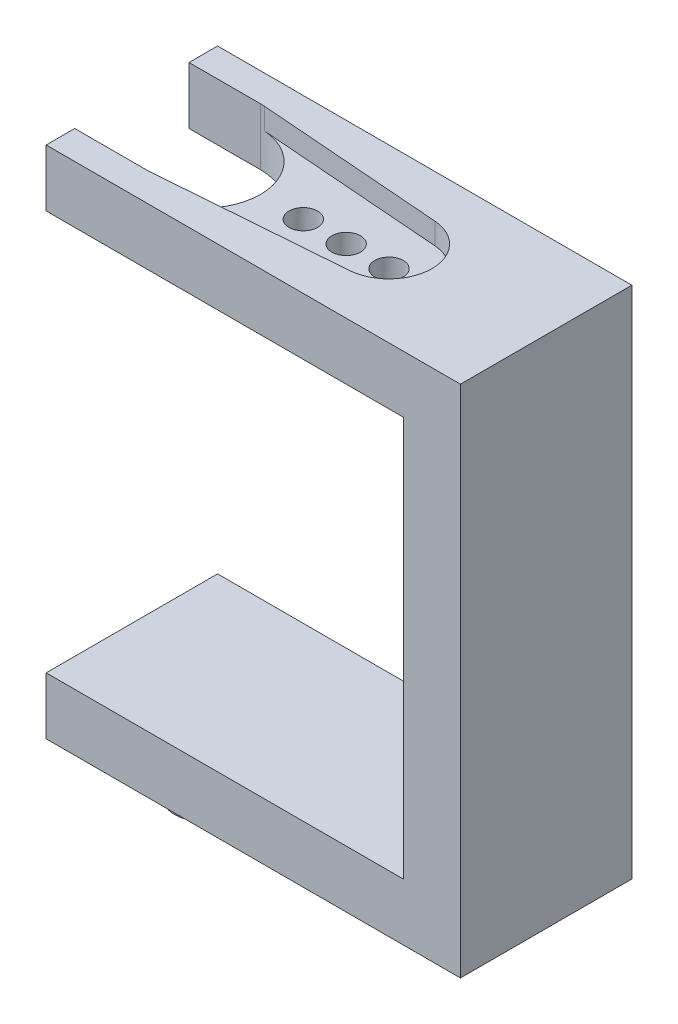
ISO-10303-21;
HEADER;
FILE_DESCRIPTION(('STEP AP214'),'2;1');
FILE_NAME('part.step','',(''),(''),'','','');
FILE_SCHEMA(('AUTOMOTIVE_DESIGN { 1 0 10303 214 1 1 1 1 }'));
ENDSEC;
DATA;
#1=APPLICATION_CONTEXT('core data for automotive mechanical design processes');
#2=APPLICATION_PROTOCOL_DEFINITION('international standard','automotive_design',2000,#1);
#3=PRODUCT_CONTEXT('',#1,'mechanical');
#4=PRODUCT('Part','Part','',(#3));
#5=PRODUCT_RELATED_PRODUCT_CATEGORY('part','',(#4));
#6=PRODUCT_DEFINITION_FORMATION('','',#4);
#7=PRODUCT_DEFINITION_CONTEXT('part definition',#1,'design');
#8=PRODUCT_DEFINITION('design','',#6,#7);
#9=PRODUCT_DEFINITION_SHAPE('','',#8);
#10=(LENGTH_UNIT() NAMED_UNIT(*) SI_UNIT(.MILLI.,.METRE.));
#11=(NAMED_UNIT(*) PLANE_ANGLE_UNIT() SI_UNIT($,.RADIAN.));
#12=(NAMED_UNIT(*) SI_UNIT($,.STERADIAN.) SOLID_ANGLE_UNIT());
#13=UNCERTAINTY_MEASURE_WITH_UNIT(LENGTH_MEASURE(1.E-05),#10,'distance_accuracy_value','');
#14=(GEOMETRIC_REPRESENTATION_CONTEXT(3) GLOBAL_UNCERTAINTY_ASSIGNED_CONTEXT((#13)) GLOBAL_UNIT_ASSIGNED_CONTEXT((#10,
#11,#12)) REPRESENTATION_CONTEXT('',''));
#15=CARTESIAN_POINT('',(0.,0.,0.));
#16=DIRECTION('',(0.,0.,1.));
#17=DIRECTION('',(1.,0.,0.));
#18=AXIS2_PLACEMENT_3D('',#15,#16,#17);
#19=CARTESIAN_POINT('',(29.,32.,12.));
#20=DIRECTION('',(0.,-1.,0.));
#21=DIRECTION('',(0.,0.,-1.));
#22=AXIS2_PLACEMENT_3D('',#19,#20,#21);
#23=PLANE('',#22);
#24=DIRECTION('',(0.997037030524286,0.,0.0769230769230774));
#25=VECTOR('',#24,1.);
#26=CARTESIAN_POINT('',(-0.12289283065618,32.,1.59287313835209));
#27=LINE('',#26,#25);
#28=CARTESIAN_POINT('',(5.30769230769231,32.,2.01185187790285));
#29=VERTEX_POINT('',#28);
#30=CARTESIAN_POINT('',(18.2307692307692,32.,3.00888890842714));
#31=VERTEX_POINT('',#30);
#32=EDGE_CURVE('E279',#29,#31,#27,.T.);
#33=ORIENTED_EDGE('',*,*,#32,.T.);
#34=CARTESIAN_POINT('',(18.,32.,6.));
#35=DIRECTION('',(0.,1.,0.));
#36=DIRECTION('',(0.,0.,1.));
#37=AXIS2_PLACEMENT_3D('',#34,#35,#36);
#38=CIRCLE('',#37,3.);
#39=CARTESIAN_POINT('',(18.2307692307692,32.,8.99111109157286));
#40=VERTEX_POINT('',#39);
#41=EDGE_CURVE('E288',#40,#31,#38,.T.);
#42=ORIENTED_EDGE('',*,*,#41,.F.);
#43=DIRECTION('',(0.997037030524286,0.,-0.0769230769230773));
#44=VECTOR('',#43,1.);
#45=CARTESIAN_POINT('',(0.797449043673935,32.,10.3361209444881));
#46=LINE('',#45,#44);
#47=CARTESIAN_POINT('',(5.30769230769231,32.,9.98814812209715));
#48=VERTEX_POINT('',#47);
#49=EDGE_CURVE('E293',#48,#40,#46,.T.);
#50=ORIENTED_EDGE('',*,*,#49,.F.);
#51=CARTESIAN_POINT('',(5.,32.,6.));
#52=DIRECTION('',(0.,1.,0.));
#53=DIRECTION('',(0.,0.,1.));
#54=AXIS2_PLACEMENT_3D('',#51,#52,#53);
#55=CIRCLE('',#54,4.);
#56=CARTESIAN_POINT('',(5.,32.,10.));
#57=VERTEX_POINT('',#56);
#58=EDGE_CURVE('E173',#57,#48,#55,.T.);
#59=ORIENTED_EDGE('',*,*,#58,.F.);
#60=DIRECTION('',(1.,0.,0.));
#61=VECTOR('',#60,1.);
#62=CARTESIAN_POINT('',(5.,32.,10.));
#63=LINE('',#62,#61);
#64=CARTESIAN_POINT('',(0.,32.,10.));
#65=VERTEX_POINT('',#64);
#66=EDGE_CURVE('E185',#65,#57,#63,.T.);
#67=ORIENTED_EDGE('',*,*,#66,.F.);
#68=DIRECTION('',(0.,0.,-1.));
#69=VECTOR('',#68,1.);
#70=CARTESIAN_POINT('',(0.,32.,12.));
#71=LINE('',#70,#69);
#72=CARTESIAN_POINT('',(0.,32.,12.));
#73=VERTEX_POINT('',#72);
#74=EDGE_CURVE('E246',#73,#65,#71,.T.);
#75=ORIENTED_EDGE('',*,*,#74,.F.);
#76=DIRECTION('',(-1.,0.,0.));
#77=VECTOR('',#76,1.);
#78=CARTESIAN_POINT('',(29.,32.,12.));
#79=LINE('',#78,#77);
#80=CARTESIAN_POINT('',(29.,32.,12.));
#81=VERTEX_POINT('',#80);
#82=EDGE_CURVE('E205',#81,#73,#79,.T.);
#83=ORIENTED_EDGE('',*,*,#82,.F.);
#84=DIRECTION('',(0.,0.,-1.));
#85=VECTOR('',#84,1.);
#86=CARTESIAN_POINT('',(29.,32.,12.));
#87=LINE('',#86,#85);
#88=CARTESIAN_POINT('',(29.,32.,0.));
#89=VERTEX_POINT('',#88);
#90=EDGE_CURVE('E249',#81,#89,#87,.T.);
#91=ORIENTED_EDGE('',*,*,#90,.T.);
#92=DIRECTION('',(-1.,0.,0.));
#93=VECTOR('',#92,1.);
#94=CARTESIAN_POINT('',(29.,32.,0.));
#95=LINE('',#94,#93);
#96=CARTESIAN_POINT('',(0.,32.,0.));
#97=VERTEX_POINT('',#96);
#98=EDGE_CURVE('E222',#89,#97,#95,.T.);
#99=ORIENTED_EDGE('',*,*,#98,.T.);
#100=CARTESIAN_POINT('',(0.,32.,2.));
#101=VERTEX_POINT('',#100);
#102=EDGE_CURVE('E245',#101,#97,#71,.T.);
#103=ORIENTED_EDGE('',*,*,#102,.F.);
#104=DIRECTION('',(-1.,0.,0.));
#105=VECTOR('',#104,1.);
#106=CARTESIAN_POINT('',(5.,32.,2.));
#107=LINE('',#106,#105);
#108=CARTESIAN_POINT('',(5.,32.,2.));
#109=VERTEX_POINT('',#108);
#110=EDGE_CURVE('E182',#109,#101,#107,.T.);
#111=ORIENTED_EDGE('',*,*,#110,.F.);
#112=EDGE_CURVE('E183',#29,#109,#55,.T.);
#113=ORIENTED_EDGE('',*,*,#112,.F.);
#114=EDGE_LOOP('',(#33,#42,#50,#59,#67,#75,#83,#91,#99,#103,#111,#113));
#115=FACE_BOUND('',#114,.T.);
#116=ADVANCED_FACE('F41',(#115),#23,.F.);
#117=CARTESIAN_POINT('',(5.,26.9,6.));
#118=DIRECTION('',(0.,1.,0.));
#119=DIRECTION('',(0.,0.,1.));
#120=AXIS2_PLACEMENT_3D('',#117,#118,#119);
#121=CYLINDRICAL_SURFACE('',#120,4.);
#122=DIRECTION('',(0.,1.,0.));
#123=VECTOR('',#122,1.);
#124=CARTESIAN_POINT('',(5.30769230769231,30.5,2.01185187790285));
#125=LINE('',#124,#123);
#126=CARTESIAN_POINT('',(5.30769230769231,30.5,2.01185187790285));
#127=VERTEX_POINT('',#126);
#128=EDGE_CURVE('E174',#127,#29,#125,.T.);
#129=ORIENTED_EDGE('',*,*,#128,.T.);
#130=ORIENTED_EDGE('',*,*,#112,.T.);
#131=DIRECTION('',(0.,1.,0.));
#132=VECTOR('',#131,1.);
#133=CARTESIAN_POINT('',(5.,26.9,2.));
#134=LINE('',#133,#132);
#135=CARTESIAN_POINT('',(5.,28.,2.));
#136=VERTEX_POINT('',#135);
#137=EDGE_CURVE('E188',#136,#109,#134,.T.);
#138=ORIENTED_EDGE('',*,*,#137,.F.);
#139=CARTESIAN_POINT('',(5.,28.,6.));
#140=DIRECTION('',(0.,1.,0.));
#141=DIRECTION('',(-1.,0.,0.));
#142=AXIS2_PLACEMENT_3D('',#139,#140,#141);
#143=CIRCLE('',#142,4.);
#144=CARTESIAN_POINT('',(5.,28.,10.));
#145=VERTEX_POINT('',#144);
#146=EDGE_CURVE('E260',#145,#136,#143,.T.);
#147=ORIENTED_EDGE('',*,*,#146,.F.);
#148=DIRECTION('',(0.,1.,0.));
#149=VECTOR('',#148,1.);
#150=CARTESIAN_POINT('',(5.,26.9,10.));
#151=LINE('',#150,#149);
#152=EDGE_CURVE('E189',#145,#57,#151,.T.);
#153=ORIENTED_EDGE('',*,*,#152,.T.);
#154=ORIENTED_EDGE('',*,*,#58,.T.);
#155=DIRECTION('',(0.,1.,0.));
#156=VECTOR('',#155,1.);
#157=CARTESIAN_POINT('',(5.30769230769231,30.5,9.98814812209715));
#158=LINE('',#157,#156);
#159=CARTESIAN_POINT('',(5.30769230769231,30.5,9.98814812209715));
#160=VERTEX_POINT('',#159);
#161=EDGE_CURVE('E158',#160,#48,#158,.T.);
#162=ORIENTED_EDGE('',*,*,#161,.F.);
#163=CARTESIAN_POINT('',(5.,30.5,6.));
#164=DIRECTION('',(0.,1.,0.));
#165=DIRECTION('',(0.,0.,1.));
#166=AXIS2_PLACEMENT_3D('',#163,#164,#165);
#167=CIRCLE('',#166,4.);
#168=EDGE_CURVE('E163',#127,#160,#167,.F.);
#169=ORIENTED_EDGE('',*,*,#168,.F.);
#170=EDGE_LOOP('',(#129,#130,#138,#147,#153,#154,#162,#169));
#171=FACE_BOUND('',#170,.T.);
#172=ADVANCED_FACE('F171',(#171),#121,.F.);
#173=CARTESIAN_POINT('',(0.,32.,12.));
#174=DIRECTION('',(1.,0.,0.));
#175=DIRECTION('',(0.,1.,0.));
#176=AXIS2_PLACEMENT_3D('',#173,#174,#175);
#177=PLANE('',#176);
#178=ORIENTED_EDGE('',*,*,#74,.T.);
#179=DIRECTION('',(0.,1.,0.));
#180=VECTOR('',#179,1.);
#181=CARTESIAN_POINT('',(0.,26.9,10.));
#182=LINE('',#181,#180);
#183=CARTESIAN_POINT('',(0.,28.,10.));
#184=VERTEX_POINT('',#183);
#185=EDGE_CURVE('E192',#184,#65,#182,.T.);
#186=ORIENTED_EDGE('',*,*,#185,.F.);
#187=DIRECTION('',(0.,0.,-1.));
#188=VECTOR('',#187,1.);
#189=CARTESIAN_POINT('',(0.,28.,12.));
#190=LINE('',#189,#188);
#191=CARTESIAN_POINT('',(0.,28.,12.));
#192=VERTEX_POINT('',#191);
#193=EDGE_CURVE('E242',#192,#184,#190,.T.);
#194=ORIENTED_EDGE('',*,*,#193,.F.);
#195=DIRECTION('',(0.,-1.,0.));
#196=VECTOR('',#195,1.);
#197=CARTESIAN_POINT('',(0.,32.,12.));
#198=LINE('',#197,#196);
#199=EDGE_CURVE('E207',#73,#192,#198,.T.);
#200=ORIENTED_EDGE('',*,*,#199,.F.);
#201=EDGE_LOOP('',(#178,#186,#194,#200));
#202=FACE_BOUND('',#201,.T.);
#203=ADVANCED_FACE('F338',(#202),#177,.F.);
#204=CARTESIAN_POINT('',(0.,0.,12.));
#205=DIRECTION('',(1.,0.,0.));
#206=DIRECTION('',(0.,0.,-1.));
#207=AXIS2_PLACEMENT_3D('',#204,#205,#206);
#208=PLANE('',#207);
#209=DIRECTION('',(0.,-1.,0.));
#210=VECTOR('',#209,1.);
#211=CARTESIAN_POINT('',(0.,0.,0.));
#212=LINE('',#211,#210);
#213=CARTESIAN_POINT('',(0.,0.,0.));
#214=VERTEX_POINT('',#213);
#215=CARTESIAN_POINT('',(0.,-4.,0.));
#216=VERTEX_POINT('',#215);
#217=EDGE_CURVE('E191',#214,#216,#212,.T.);
#218=ORIENTED_EDGE('',*,*,#217,.T.);
#219=DIRECTION('',(0.,0.,-1.));
#220=VECTOR('',#219,1.);
#221=CARTESIAN_POINT('',(0.,-4.,12.));
#222=LINE('',#221,#220);
#223=CARTESIAN_POINT('',(0.,-4.,12.));
#224=VERTEX_POINT('',#223);
#225=EDGE_CURVE('E255',#224,#216,#222,.T.);
#226=ORIENTED_EDGE('',*,*,#225,.F.);
#227=DIRECTION('',(0.,-1.,0.));
#228=VECTOR('',#227,1.);
#229=CARTESIAN_POINT('',(0.,0.,12.));
#230=LINE('',#229,#228);
#231=CARTESIAN_POINT('',(0.,0.,12.));
#232=VERTEX_POINT('',#231);
#233=EDGE_CURVE('E197',#232,#224,#230,.T.);
#234=ORIENTED_EDGE('',*,*,#233,.F.);
#235=DIRECTION('',(0.,0.,-1.));
#236=VECTOR('',#235,1.);
#237=CARTESIAN_POINT('',(0.,0.,12.));
#238=LINE('',#237,#236);
#239=EDGE_CURVE('E215',#232,#214,#238,.T.);
#240=ORIENTED_EDGE('',*,*,#239,.T.);
#241=EDGE_LOOP('',(#218,#226,#234,#240));
#242=FACE_BOUND('',#241,.T.);
#243=ADVANCED_FACE('F43',(#242),#208,.F.);
#244=CARTESIAN_POINT('',(0.,-4.,12.));
#245=DIRECTION('',(0.,1.,0.));
#246=DIRECTION('',(0.,0.,1.));
#247=AXIS2_PLACEMENT_3D('',#244,#245,#246);
#248=PLANE('',#247);
#249=CARTESIAN_POINT('',(5.,-4.,6.));
#250=DIRECTION('',(0.,1.,0.));
#251=DIRECTION('',(0.,0.,1.));
#252=AXIS2_PLACEMENT_3D('',#249,#250,#251);
#253=CIRCLE('',#252,2.);
#254=CARTESIAN_POINT('',(5.,-4.,8.));
#255=VERTEX_POINT('',#254);
#256=EDGE_CURVE('E11',#255,#255,#253,.F.);
#257=ORIENTED_EDGE('',*,*,#256,.F.);
#258=EDGE_LOOP('',(#257));
#259=FACE_BOUND('',#258,.T.);
#260=DIRECTION('',(1.,0.,0.));
#261=VECTOR('',#260,1.);
#262=CARTESIAN_POINT('',(0.,-4.,0.));
#263=LINE('',#262,#261);
#264=CARTESIAN_POINT('',(29.,-4.,0.));
#265=VERTEX_POINT('',#264);
#266=EDGE_CURVE('E218',#216,#265,#263,.T.);
#267=ORIENTED_EDGE('',*,*,#266,.T.);
#268=DIRECTION('',(0.,0.,-1.));
#269=VECTOR('',#268,1.);
#270=CARTESIAN_POINT('',(29.,-4.,12.));
#271=LINE('',#270,#269);
#272=CARTESIAN_POINT('',(29.,-4.,12.));
#273=VERTEX_POINT('',#272);
#274=EDGE_CURVE('E252',#273,#265,#271,.T.);
#275=ORIENTED_EDGE('',*,*,#274,.F.);
#276=DIRECTION('',(1.,0.,0.));
#277=VECTOR('',#276,1.);
#278=CARTESIAN_POINT('',(0.,-4.,12.));
#279=LINE('',#278,#277);
#280=EDGE_CURVE('E200',#224,#273,#279,.T.);
#281=ORIENTED_EDGE('',*,*,#280,.F.);
#282=ORIENTED_EDGE('',*,*,#225,.T.);
#283=EDGE_LOOP('',(#267,#275,#281,#282));
#284=FACE_BOUND('',#283,.T.);
#285=ADVANCED_FACE('F345',(#259,#284),#248,.F.);
#286=CARTESIAN_POINT('',(29.,-4.,12.));
#287=DIRECTION('',(-1.,0.,0.));
#288=DIRECTION('',(0.,0.,1.));
#289=AXIS2_PLACEMENT_3D('',#286,#287,#288);
#290=PLANE('',#289);
#291=DIRECTION('',(0.,1.,0.));
#292=VECTOR('',#291,1.);
#293=CARTESIAN_POINT('',(29.,-4.,0.));
#294=LINE('',#293,#292);
#295=EDGE_CURVE('E220',#265,#89,#294,.T.);
#296=ORIENTED_EDGE('',*,*,#295,.T.);
#297=ORIENTED_EDGE('',*,*,#90,.F.);
#298=DIRECTION('',(0.,1.,0.));
#299=VECTOR('',#298,1.);
#300=CARTESIAN_POINT('',(29.,-4.,12.));
#301=LINE('',#300,#299);
#302=EDGE_CURVE('E203',#273,#81,#301,.T.);
#303=ORIENTED_EDGE('',*,*,#302,.F.);
#304=ORIENTED_EDGE('',*,*,#274,.T.);
#305=EDGE_LOOP('',(#296,#297,#303,#304));
#306=FACE_BOUND('',#305,.T.);
#307=ADVANCED_FACE('F343',(#306),#290,.F.);
#308=CARTESIAN_POINT('',(0.,28.,2.));
#309=VERTEX_POINT('',#308);
#310=CARTESIAN_POINT('',(0.,28.,0.));
#311=VERTEX_POINT('',#310);
#312=EDGE_CURVE('E241',#309,#311,#190,.T.);
#313=ORIENTED_EDGE('',*,*,#312,.F.);
#314=DIRECTION('',(0.,1.,0.));
#315=VECTOR('',#314,1.);
#316=CARTESIAN_POINT('',(0.,26.9,2.));
#317=LINE('',#316,#315);
#318=EDGE_CURVE('E64',#309,#101,#317,.T.);
#319=ORIENTED_EDGE('',*,*,#318,.T.);
#320=ORIENTED_EDGE('',*,*,#102,.T.);
#321=DIRECTION('',(0.,-1.,0.));
#322=VECTOR('',#321,1.);
#323=CARTESIAN_POINT('',(0.,32.,0.));
#324=LINE('',#323,#322);
#325=EDGE_CURVE('E225',#97,#311,#324,.T.);
#326=ORIENTED_EDGE('',*,*,#325,.T.);
#327=EDGE_LOOP('',(#313,#319,#320,#326));
#328=FACE_BOUND('',#327,.T.);
#329=ADVANCED_FACE('F308',(#328),#177,.F.);
#330=CARTESIAN_POINT('',(25.,28.,12.));
#331=DIRECTION('',(0.,1.,0.));
#332=DIRECTION('',(-1.,0.,0.));
#333=AXIS2_PLACEMENT_3D('',#330,#331,#332);
#334=PLANE('',#333);
#335=CARTESIAN_POINT('',(12.,28.,6.));
#336=DIRECTION('',(0.,1.,0.));
#337=DIRECTION('',(-1.,0.,0.));
#338=AXIS2_PLACEMENT_3D('',#335,#336,#337);
#339=CIRCLE('',#338,1.);
#340=CARTESIAN_POINT('',(11.,28.,6.));
#341=VERTEX_POINT('',#340);
#342=EDGE_CURVE('E275',#341,#341,#339,.T.);
#343=ORIENTED_EDGE('',*,*,#342,.T.);
#344=EDGE_LOOP('',(#343));
#345=FACE_BOUND('',#344,.T.);
#346=CARTESIAN_POINT('',(15.,28.,6.));
#347=DIRECTION('',(0.,1.,0.));
#348=DIRECTION('',(-1.,0.,0.));
#349=AXIS2_PLACEMENT_3D('',#346,#347,#348);
#350=CIRCLE('',#349,1.);
#351=CARTESIAN_POINT('',(14.,28.,6.));
#352=VERTEX_POINT('',#351);
#353=EDGE_CURVE('E272',#352,#352,#350,.T.);
#354=ORIENTED_EDGE('',*,*,#353,.T.);
#355=EDGE_LOOP('',(#354));
#356=FACE_BOUND('',#355,.T.);
#357=CARTESIAN_POINT('',(18.,28.,6.));
#358=DIRECTION('',(0.,1.,0.));
#359=DIRECTION('',(-1.,0.,0.));
#360=AXIS2_PLACEMENT_3D('',#357,#358,#359);
#361=CIRCLE('',#360,1.);
#362=CARTESIAN_POINT('',(17.,28.,6.));
#363=VERTEX_POINT('',#362);
#364=EDGE_CURVE('E268',#363,#363,#361,.T.);
#365=ORIENTED_EDGE('',*,*,#364,.T.);
#366=EDGE_LOOP('',(#365));
#367=FACE_BOUND('',#366,.T.);
#368=ORIENTED_EDGE('',*,*,#193,.T.);
#369=DIRECTION('',(1.,0.,0.));
#370=VECTOR('',#369,1.);
#371=CARTESIAN_POINT('',(25.,28.,10.));
#372=LINE('',#371,#370);
#373=EDGE_CURVE('E49',#184,#145,#372,.T.);
#374=ORIENTED_EDGE('',*,*,#373,.T.);
#375=ORIENTED_EDGE('',*,*,#146,.T.);
#376=DIRECTION('',(-1.,0.,0.));
#377=VECTOR('',#376,1.);
#378=CARTESIAN_POINT('',(25.,28.,2.));
#379=LINE('',#378,#377);
#380=EDGE_CURVE('E258',#136,#309,#379,.T.);
#381=ORIENTED_EDGE('',*,*,#380,.T.);
#382=ORIENTED_EDGE('',*,*,#312,.T.);
#383=DIRECTION('',(1.,0.,0.));
#384=VECTOR('',#383,1.);
#385=CARTESIAN_POINT('',(25.,28.,0.));
#386=LINE('',#385,#384);
#387=CARTESIAN_POINT('',(25.,28.,0.));
#388=VERTEX_POINT('',#387);
#389=EDGE_CURVE('E228',#311,#388,#386,.T.);
#390=ORIENTED_EDGE('',*,*,#389,.T.);
#391=DIRECTION('',(0.,0.,-1.));
#392=VECTOR('',#391,1.);
#393=CARTESIAN_POINT('',(25.,28.,12.));
#394=LINE('',#393,#392);
#395=CARTESIAN_POINT('',(25.,28.,12.));
#396=VERTEX_POINT('',#395);
#397=EDGE_CURVE('E238',#396,#388,#394,.T.);
#398=ORIENTED_EDGE('',*,*,#397,.F.);
#399=DIRECTION('',(1.,0.,0.));
#400=VECTOR('',#399,1.);
#401=CARTESIAN_POINT('',(25.,28.,12.));
#402=LINE('',#401,#400);
#403=EDGE_CURVE('E209',#192,#396,#402,.T.);
#404=ORIENTED_EDGE('',*,*,#403,.F.);
#405=EDGE_LOOP('',(#368,#374,#375,#381,#382,#390,#398,#404));
#406=FACE_BOUND('',#405,.T.);
#407=ADVANCED_FACE('F311',(#345,#356,#367,#406),#334,.F.);
#408=CARTESIAN_POINT('',(25.,0.,12.));
#409=DIRECTION('',(1.,0.,0.));
#410=DIRECTION('',(0.,0.,-1.));
#411=AXIS2_PLACEMENT_3D('',#408,#409,#410);
#412=PLANE('',#411);
#413=DIRECTION('',(0.,-1.,0.));
#414=VECTOR('',#413,1.);
#415=CARTESIAN_POINT('',(25.,0.,0.));
#416=LINE('',#415,#414);
#417=CARTESIAN_POINT('',(25.,0.,0.));
#418=VERTEX_POINT('',#417);
#419=EDGE_CURVE('E230',#388,#418,#416,.T.);
#420=ORIENTED_EDGE('',*,*,#419,.T.);
#421=DIRECTION('',(0.,0.,-1.));
#422=VECTOR('',#421,1.);
#423=CARTESIAN_POINT('',(25.,0.,12.));
#424=LINE('',#423,#422);
#425=CARTESIAN_POINT('',(25.,0.,12.));
#426=VERTEX_POINT('',#425);
#427=EDGE_CURVE('E235',#426,#418,#424,.T.);
#428=ORIENTED_EDGE('',*,*,#427,.F.);
#429=DIRECTION('',(0.,-1.,0.));
#430=VECTOR('',#429,1.);
#431=CARTESIAN_POINT('',(25.,0.,12.));
#432=LINE('',#431,#430);
#433=EDGE_CURVE('E211',#396,#426,#432,.T.);
#434=ORIENTED_EDGE('',*,*,#433,.F.);
#435=ORIENTED_EDGE('',*,*,#397,.T.);
#436=EDGE_LOOP('',(#420,#428,#434,#435));
#437=FACE_BOUND('',#436,.T.);
#438=ADVANCED_FACE('F369',(#437),#412,.F.);
#439=CARTESIAN_POINT('',(0.,0.,12.));
#440=DIRECTION('',(0.,-1.,0.));
#441=DIRECTION('',(0.,0.,-1.));
#442=AXIS2_PLACEMENT_3D('',#439,#440,#441);
#443=PLANE('',#442);
#444=DIRECTION('',(-1.,0.,0.));
#445=VECTOR('',#444,1.);
#446=CARTESIAN_POINT('',(0.,0.,0.));
#447=LINE('',#446,#445);
#448=EDGE_CURVE('E201',#418,#214,#447,.T.);
#449=ORIENTED_EDGE('',*,*,#448,.T.);
#450=ORIENTED_EDGE('',*,*,#239,.F.);
#451=DIRECTION('',(-1.,0.,0.));
#452=VECTOR('',#451,1.);
#453=CARTESIAN_POINT('',(0.,0.,12.));
#454=LINE('',#453,#452);
#455=EDGE_CURVE('E213',#426,#232,#454,.T.);
#456=ORIENTED_EDGE('',*,*,#455,.F.);
#457=ORIENTED_EDGE('',*,*,#427,.T.);
#458=EDGE_LOOP('',(#449,#450,#456,#457));
#459=FACE_BOUND('',#458,.T.);
#460=ADVANCED_FACE('F373',(#459),#443,.F.);
#461=CARTESIAN_POINT('',(0.,0.,12.));
#462=DIRECTION('',(0.,0.,1.));
#463=DIRECTION('',(1.,0.,0.));
#464=AXIS2_PLACEMENT_3D('',#461,#462,#463);
#465=PLANE('',#464);
#466=ORIENTED_EDGE('',*,*,#233,.T.);
#467=ORIENTED_EDGE('',*,*,#280,.T.);
#468=ORIENTED_EDGE('',*,*,#302,.T.);
#469=ORIENTED_EDGE('',*,*,#82,.T.);
#470=ORIENTED_EDGE('',*,*,#199,.T.);
#471=ORIENTED_EDGE('',*,*,#403,.T.);
#472=ORIENTED_EDGE('',*,*,#433,.T.);
#473=ORIENTED_EDGE('',*,*,#455,.T.);
#474=EDGE_LOOP('',(#466,#467,#468,#469,#470,#471,#472,#473));
#475=FACE_BOUND('',#474,.T.);
#476=ADVANCED_FACE('F377',(#475),#465,.T.);
#477=CARTESIAN_POINT('',(0.,0.,0.));
#478=DIRECTION('',(0.,0.,1.));
#479=DIRECTION('',(1.,0.,0.));
#480=AXIS2_PLACEMENT_3D('',#477,#478,#479);
#481=PLANE('',#480);
#482=ORIENTED_EDGE('',*,*,#217,.F.);
#483=ORIENTED_EDGE('',*,*,#448,.F.);
#484=ORIENTED_EDGE('',*,*,#419,.F.);
#485=ORIENTED_EDGE('',*,*,#389,.F.);
#486=ORIENTED_EDGE('',*,*,#325,.F.);
#487=ORIENTED_EDGE('',*,*,#98,.F.);
#488=ORIENTED_EDGE('',*,*,#295,.F.);
#489=ORIENTED_EDGE('',*,*,#266,.F.);
#490=EDGE_LOOP('',(#482,#483,#484,#485,#486,#487,#488,#489));
#491=FACE_BOUND('',#490,.T.);
#492=ADVANCED_FACE('F364',(#491),#481,.F.);
#493=CARTESIAN_POINT('',(5.,26.9,10.));
#494=DIRECTION('',(0.,0.,1.));
#495=DIRECTION('',(1.,0.,0.));
#496=AXIS2_PLACEMENT_3D('',#493,#494,#495);
#497=PLANE('',#496);
#498=ORIENTED_EDGE('',*,*,#185,.T.);
#499=ORIENTED_EDGE('',*,*,#66,.T.);
#500=ORIENTED_EDGE('',*,*,#152,.F.);
#501=ORIENTED_EDGE('',*,*,#373,.F.);
#502=EDGE_LOOP('',(#498,#499,#500,#501));
#503=FACE_BOUND('',#502,.T.);
#504=ADVANCED_FACE('F315',(#503),#497,.F.);
#505=CARTESIAN_POINT('',(5.,26.9,2.));
#506=DIRECTION('',(0.,0.,-1.));
#507=DIRECTION('',(-1.,0.,0.));
#508=AXIS2_PLACEMENT_3D('',#505,#506,#507);
#509=PLANE('',#508);
#510=ORIENTED_EDGE('',*,*,#137,.T.);
#511=ORIENTED_EDGE('',*,*,#110,.T.);
#512=ORIENTED_EDGE('',*,*,#318,.F.);
#513=ORIENTED_EDGE('',*,*,#380,.F.);
#514=EDGE_LOOP('',(#510,#511,#512,#513));
#515=FACE_BOUND('',#514,.T.);
#516=ADVANCED_FACE('F302',(#515),#509,.F.);
#517=CARTESIAN_POINT('',(-0.12289283065618,30.5,1.59287313835209));
#518=DIRECTION('',(-0.0769230769230774,0.,0.997037030524286));
#519=DIRECTION('',(0.997037030524286,0.,0.0769230769230774));
#520=AXIS2_PLACEMENT_3D('',#517,#518,#519);
#521=PLANE('',#520);
#522=ORIENTED_EDGE('',*,*,#32,.F.);
#523=ORIENTED_EDGE('',*,*,#128,.F.);
#524=DIRECTION('',(0.997037030524286,0.,0.0769230769230774));
#525=VECTOR('',#524,1.);
#526=CARTESIAN_POINT('',(-0.12289283065618,30.5,1.59287313835209));
#527=LINE('',#526,#525);
#528=CARTESIAN_POINT('',(18.2307692307692,30.5,3.00888890842714));
#529=VERTEX_POINT('',#528);
#530=EDGE_CURVE('E56',#127,#529,#527,.T.);
#531=ORIENTED_EDGE('',*,*,#530,.T.);
#532=DIRECTION('',(0.,1.,0.));
#533=VECTOR('',#532,1.);
#534=CARTESIAN_POINT('',(18.2307692307692,30.5,3.00888890842714));
#535=LINE('',#534,#533);
#536=EDGE_CURVE('E176',#529,#31,#535,.T.);
#537=ORIENTED_EDGE('',*,*,#536,.T.);
#538=EDGE_LOOP('',(#522,#523,#531,#537));
#539=FACE_BOUND('',#538,.T.);
#540=ADVANCED_FACE('F323',(#539),#521,.T.);
#541=CARTESIAN_POINT('',(18.,30.5,6.));
#542=DIRECTION('',(0.,1.,0.));
#543=DIRECTION('',(0.,0.,1.));
#544=AXIS2_PLACEMENT_3D('',#541,#542,#543);
#545=CYLINDRICAL_SURFACE('',#544,3.);
#546=ORIENTED_EDGE('',*,*,#41,.T.);
#547=ORIENTED_EDGE('',*,*,#536,.F.);
#548=CARTESIAN_POINT('',(18.,30.5,6.));
#549=DIRECTION('',(0.,1.,0.));
#550=DIRECTION('',(0.,0.,1.));
#551=AXIS2_PLACEMENT_3D('',#548,#549,#550);
#552=CIRCLE('',#551,3.);
#553=CARTESIAN_POINT('',(18.2307692307692,30.5,8.99111109157286));
#554=VERTEX_POINT('',#553);
#555=EDGE_CURVE('E162',#554,#529,#552,.T.);
#556=ORIENTED_EDGE('',*,*,#555,.F.);
#557=DIRECTION('',(0.,1.,0.));
#558=VECTOR('',#557,1.);
#559=CARTESIAN_POINT('',(18.2307692307692,30.5,8.99111109157286));
#560=LINE('',#559,#558);
#561=EDGE_CURVE('E160',#554,#40,#560,.T.);
#562=ORIENTED_EDGE('',*,*,#561,.T.);
#563=EDGE_LOOP('',(#546,#547,#556,#562));
#564=FACE_BOUND('',#563,.T.);
#565=ADVANCED_FACE('F321',(#564),#545,.F.);
#566=CARTESIAN_POINT('',(0.797449043673935,30.5,10.3361209444881));
#567=DIRECTION('',(0.0769230769230773,0.,0.997037030524286));
#568=DIRECTION('',(0.997037030524286,0.,-0.0769230769230773));
#569=AXIS2_PLACEMENT_3D('',#566,#567,#568);
#570=PLANE('',#569);
#571=ORIENTED_EDGE('',*,*,#49,.T.);
#572=ORIENTED_EDGE('',*,*,#561,.F.);
#573=DIRECTION('',(0.997037030524286,0.,-0.0769230769230773));
#574=VECTOR('',#573,1.);
#575=CARTESIAN_POINT('',(0.797449043673935,30.5,10.3361209444881));
#576=LINE('',#575,#574);
#577=EDGE_CURVE('E154',#160,#554,#576,.T.);
#578=ORIENTED_EDGE('',*,*,#577,.F.);
#579=ORIENTED_EDGE('',*,*,#161,.T.);
#580=EDGE_LOOP('',(#571,#572,#578,#579));
#581=FACE_BOUND('',#580,.T.);
#582=ADVANCED_FACE('F156',(#581),#570,.F.);
#583=CARTESIAN_POINT('',(0.,30.5,0.));
#584=DIRECTION('',(0.,1.,0.));
#585=DIRECTION('',(0.,0.,1.));
#586=AXIS2_PLACEMENT_3D('',#583,#584,#585);
#587=PLANE('',#586);
#588=CARTESIAN_POINT('',(12.,30.5,6.));
#589=DIRECTION('',(0.,1.,0.));
#590=DIRECTION('',(0.,0.,1.));
#591=AXIS2_PLACEMENT_3D('',#588,#589,#590);
#592=CIRCLE('',#591,1.);
#593=CARTESIAN_POINT('',(12.,30.5,7.));
#594=VERTEX_POINT('',#593);
#595=EDGE_CURVE('E273',#594,#594,#592,.T.);
#596=ORIENTED_EDGE('',*,*,#595,.F.);
#597=EDGE_LOOP('',(#596));
#598=FACE_BOUND('',#597,.T.);
#599=CARTESIAN_POINT('',(15.,30.5,6.));
#600=DIRECTION('',(0.,1.,0.));
#601=DIRECTION('',(0.,0.,1.));
#602=AXIS2_PLACEMENT_3D('',#599,#600,#601);
#603=CIRCLE('',#602,1.);
#604=CARTESIAN_POINT('',(15.,30.5,7.));
#605=VERTEX_POINT('',#604);
#606=EDGE_CURVE('E270',#605,#605,#603,.T.);
#607=ORIENTED_EDGE('',*,*,#606,.F.);
#608=EDGE_LOOP('',(#607));
#609=FACE_BOUND('',#608,.T.);
#610=CARTESIAN_POINT('',(18.,30.5,6.));
#611=DIRECTION('',(0.,1.,0.));
#612=DIRECTION('',(0.,0.,1.));
#613=AXIS2_PLACEMENT_3D('',#610,#611,#612);
#614=CIRCLE('',#613,1.);
#615=CARTESIAN_POINT('',(18.,30.5,7.));
#616=VERTEX_POINT('',#615);
#617=EDGE_CURVE('E265',#616,#616,#614,.T.);
#618=ORIENTED_EDGE('',*,*,#617,.F.);
#619=EDGE_LOOP('',(#618));
#620=FACE_BOUND('',#619,.T.);
#621=ORIENTED_EDGE('',*,*,#530,.F.);
#622=ORIENTED_EDGE('',*,*,#168,.T.);
#623=ORIENTED_EDGE('',*,*,#577,.T.);
#624=ORIENTED_EDGE('',*,*,#555,.T.);
#625=EDGE_LOOP('',(#621,#622,#623,#624));
#626=FACE_BOUND('',#625,.T.);
#627=ADVANCED_FACE('F166',(#598,#609,#620,#626),#587,.T.);
#628=CARTESIAN_POINT('',(18.,25.5,6.));
#629=DIRECTION('',(0.,1.,0.));
#630=DIRECTION('',(0.,0.,1.));
#631=AXIS2_PLACEMENT_3D('',#628,#629,#630);
#632=CYLINDRICAL_SURFACE('',#631,1.);
#633=ORIENTED_EDGE('',*,*,#617,.T.);
#634=EDGE_LOOP('',(#633));
#635=FACE_BOUND('',#634,.T.);
#636=ORIENTED_EDGE('',*,*,#364,.F.);
#637=EDGE_LOOP('',(#636));
#638=FACE_BOUND('',#637,.T.);
#639=ADVANCED_FACE('F447',(#635,#638),#632,.F.);
#640=CARTESIAN_POINT('',(15.,25.5,6.));
#641=DIRECTION('',(0.,1.,0.));
#642=DIRECTION('',(0.,0.,1.));
#643=AXIS2_PLACEMENT_3D('',#640,#641,#642);
#644=CYLINDRICAL_SURFACE('',#643,1.);
#645=ORIENTED_EDGE('',*,*,#606,.T.);
#646=EDGE_LOOP('',(#645));
#647=FACE_BOUND('',#646,.T.);
#648=ORIENTED_EDGE('',*,*,#353,.F.);
#649=EDGE_LOOP('',(#648));
#650=FACE_BOUND('',#649,.T.);
#651=ADVANCED_FACE('F462',(#647,#650),#644,.F.);
#652=CARTESIAN_POINT('',(12.,25.5,6.));
#653=DIRECTION('',(0.,1.,0.));
#654=DIRECTION('',(0.,0.,1.));
#655=AXIS2_PLACEMENT_3D('',#652,#653,#654);
#656=CYLINDRICAL_SURFACE('',#655,1.);
#657=ORIENTED_EDGE('',*,*,#595,.T.);
#658=EDGE_LOOP('',(#657));
#659=FACE_BOUND('',#658,.T.);
#660=ORIENTED_EDGE('',*,*,#342,.F.);
#661=EDGE_LOOP('',(#660));
#662=FACE_BOUND('',#661,.T.);
#663=ADVANCED_FACE('F472',(#659,#662),#656,.F.);
#664=CARTESIAN_POINT('',(5.,-8.1,6.));
#665=DIRECTION('',(0.,1.,0.));
#666=DIRECTION('',(0.,0.,1.));
#667=AXIS2_PLACEMENT_3D('',#664,#665,#666);
#668=CYLINDRICAL_SURFACE('',#667,2.);
#669=CARTESIAN_POINT('',(5.,-8.1,6.));
#670=DIRECTION('',(0.,-1.,0.));
#671=DIRECTION('',(0.,0.,-1.));
#672=AXIS2_PLACEMENT_3D('',#669,#670,#671);
#673=CIRCLE('',#672,2.);
#674=CARTESIAN_POINT('',(5.,-8.1,4.));
#675=VERTEX_POINT('',#674);
#676=EDGE_CURVE('E269',#675,#675,#673,.T.);
#677=ORIENTED_EDGE('',*,*,#676,.F.);
#678=EDGE_LOOP('',(#677));
#679=FACE_BOUND('',#678,.T.);
#680=ORIENTED_EDGE('',*,*,#256,.T.);
#681=EDGE_LOOP('',(#680));
#682=FACE_BOUND('',#681,.T.);
#683=ADVANCED_FACE('F481',(#679,#682),#668,.T.);
#684=CARTESIAN_POINT('',(5.,-8.1,6.));
#685=DIRECTION('',(0.,-1.,0.));
#686=DIRECTION('',(0.,0.,-1.));
#687=AXIS2_PLACEMENT_3D('',#684,#685,#686);
#688=PLANE('',#687);
#689=ORIENTED_EDGE('',*,*,#676,.T.);
#690=EDGE_LOOP('',(#689));
#691=FACE_BOUND('',#690,.T.);
#692=ADVANCED_FACE('F489',(#691),#688,.T.);
#693=CLOSED_SHELL('',(#116,#172,#203,#243,#285,#307,#329,#407,#438,#460,#476,#492,#504,#516,
#540,#565,#582,#627,#639,#651,#663,#683,#692));
#694=MANIFOLD_SOLID_BREP('B2',#693);
#695=ADVANCED_BREP_SHAPE_REPRESENTATION('',(#18,#694),#14);
#696=SHAPE_DEFINITION_REPRESENTATION(#9,#695);
ENDSEC;
END-ISO-10303-21;
